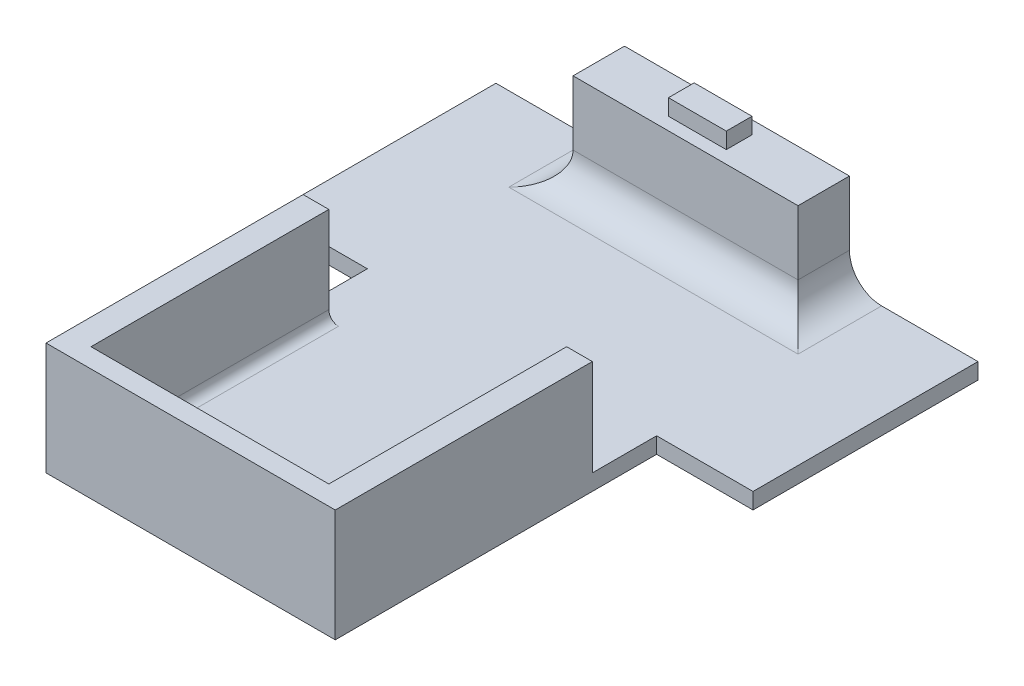
ISO-10303-21;
HEADER;
FILE_DESCRIPTION(('STEP AP214'),'2;1');
FILE_NAME('part.step','',(''),(''),'','','');
FILE_SCHEMA(('AUTOMOTIVE_DESIGN { 1 0 10303 214 1 1 1 1 }'));
ENDSEC;
DATA;
#1=APPLICATION_CONTEXT('core data for automotive mechanical design processes');
#2=APPLICATION_PROTOCOL_DEFINITION('international standard','automotive_design',2000,#1);
#3=PRODUCT_CONTEXT('',#1,'mechanical');
#4=PRODUCT('Part','Part','',(#3));
#5=PRODUCT_RELATED_PRODUCT_CATEGORY('part','',(#4));
#6=PRODUCT_DEFINITION_FORMATION('','',#4);
#7=PRODUCT_DEFINITION_CONTEXT('part definition',#1,'design');
#8=PRODUCT_DEFINITION('design','',#6,#7);
#9=PRODUCT_DEFINITION_SHAPE('','',#8);
#10=(LENGTH_UNIT() NAMED_UNIT(*) SI_UNIT(.MILLI.,.METRE.));
#11=(NAMED_UNIT(*) PLANE_ANGLE_UNIT() SI_UNIT($,.RADIAN.));
#12=(NAMED_UNIT(*) SI_UNIT($,.STERADIAN.) SOLID_ANGLE_UNIT());
#13=UNCERTAINTY_MEASURE_WITH_UNIT(LENGTH_MEASURE(1.E-05),#10,'distance_accuracy_value','');
#14=(GEOMETRIC_REPRESENTATION_CONTEXT(3) GLOBAL_UNCERTAINTY_ASSIGNED_CONTEXT((#13)) GLOBAL_UNIT_ASSIGNED_CONTEXT((#10,
#11,#12)) REPRESENTATION_CONTEXT('',''));
#15=CARTESIAN_POINT('',(0.,0.,0.));
#16=DIRECTION('',(0.,0.,1.));
#17=DIRECTION('',(1.,0.,0.));
#18=AXIS2_PLACEMENT_3D('',#15,#16,#17);
#19=CARTESIAN_POINT('',(0.,5.,0.));
#20=DIRECTION('',(0.,-1.,0.));
#21=DIRECTION('',(0.,0.,-1.));
#22=AXIS2_PLACEMENT_3D('',#19,#20,#21);
#23=PLANE('',#22);
#24=DIRECTION('',(-1.,0.,0.));
#25=VECTOR('',#24,1.);
#26=CARTESIAN_POINT('',(0.,5.,4.99999999999999));
#27=LINE('',#26,#25);
#28=CARTESIAN_POINT('',(-34.,5.,4.99999999999999));
#29=VERTEX_POINT('',#28);
#30=CARTESIAN_POINT('',(-45.,5.,4.99999999999999));
#31=VERTEX_POINT('',#30);
#32=EDGE_CURVE('E280',#29,#31,#27,.T.);
#33=ORIENTED_EDGE('',*,*,#32,.F.);
#34=DIRECTION('',(0.,0.,1.));
#35=VECTOR('',#34,1.);
#36=CARTESIAN_POINT('',(-34.,5.,0.));
#37=LINE('',#36,#35);
#38=CARTESIAN_POINT('',(-34.,5.,76.));
#39=VERTEX_POINT('',#38);
#40=EDGE_CURVE('E477',#29,#39,#37,.T.);
#41=ORIENTED_EDGE('',*,*,#40,.T.);
#42=DIRECTION('',(1.,0.,0.));
#43=VECTOR('',#42,1.);
#44=CARTESIAN_POINT('',(0.,5.,76.));
#45=LINE('',#44,#43);
#46=CARTESIAN_POINT('',(34.,5.,76.));
#47=VERTEX_POINT('',#46);
#48=EDGE_CURVE('E473',#39,#47,#45,.T.);
#49=ORIENTED_EDGE('',*,*,#48,.T.);
#50=DIRECTION('',(0.,0.,1.));
#51=VECTOR('',#50,1.);
#52=CARTESIAN_POINT('',(34.,5.,4.99999999999999));
#53=LINE('',#52,#51);
#54=CARTESIAN_POINT('',(34.,5.,4.99999999999999));
#55=VERTEX_POINT('',#54);
#56=EDGE_CURVE('E462',#47,#55,#53,.F.);
#57=ORIENTED_EDGE('',*,*,#56,.T.);
#58=DIRECTION('',(1.,0.,0.));
#59=VECTOR('',#58,1.);
#60=CARTESIAN_POINT('',(0.,5.,5.));
#61=LINE('',#60,#59);
#62=CARTESIAN_POINT('',(45.,5.,4.99999999999999));
#63=VERTEX_POINT('',#62);
#64=EDGE_CURVE('E286',#55,#63,#61,.T.);
#65=ORIENTED_EDGE('',*,*,#64,.T.);
#66=DIRECTION('',(0.,0.,-1.));
#67=VECTOR('',#66,1.);
#68=CARTESIAN_POINT('',(45.,5.,-15.));
#69=LINE('',#68,#67);
#70=CARTESIAN_POINT('',(45.,5.,-15.));
#71=VERTEX_POINT('',#70);
#72=EDGE_CURVE('E376',#63,#71,#69,.T.);
#73=ORIENTED_EDGE('',*,*,#72,.T.);
#74=DIRECTION('',(1.,0.,0.));
#75=VECTOR('',#74,1.);
#76=CARTESIAN_POINT('',(75.,5.,-15.));
#77=LINE('',#76,#75);
#78=CARTESIAN_POINT('',(75.,5.,-15.));
#79=VERTEX_POINT('',#78);
#80=EDGE_CURVE('E379',#71,#79,#77,.T.);
#81=ORIENTED_EDGE('',*,*,#80,.T.);
#82=DIRECTION('',(0.,0.,-1.));
#83=VECTOR('',#82,1.);
#84=CARTESIAN_POINT('',(75.,5.,-15.));
#85=LINE('',#84,#83);
#86=CARTESIAN_POINT('',(75.,5.,-85.));
#87=VERTEX_POINT('',#86);
#88=EDGE_CURVE('E356',#79,#87,#85,.T.);
#89=ORIENTED_EDGE('',*,*,#88,.T.);
#90=DIRECTION('',(-1.,0.,0.));
#91=VECTOR('',#90,1.);
#92=CARTESIAN_POINT('',(-75.,5.,-85.));
#93=LINE('',#92,#91);
#94=CARTESIAN_POINT('',(45.,5.,-85.));
#95=VERTEX_POINT('',#94);
#96=EDGE_CURVE('E362',#87,#95,#93,.T.);
#97=ORIENTED_EDGE('',*,*,#96,.T.);
#98=DIRECTION('',(0.,0.,-1.));
#99=VECTOR('',#98,1.);
#100=CARTESIAN_POINT('',(45.,5.,-69.));
#101=LINE('',#100,#99);
#102=CARTESIAN_POINT('',(45.,5.,-59.));
#103=VERTEX_POINT('',#102);
#104=EDGE_CURVE('E447',#95,#103,#101,.F.);
#105=ORIENTED_EDGE('',*,*,#104,.T.);
#106=DIRECTION('',(1.,0.,0.));
#107=VECTOR('',#106,1.);
#108=CARTESIAN_POINT('',(-35.,5.,-59.));
#109=LINE('',#108,#107);
#110=CARTESIAN_POINT('',(-45.,5.,-59.));
#111=VERTEX_POINT('',#110);
#112=EDGE_CURVE('E441',#103,#111,#109,.F.);
#113=ORIENTED_EDGE('',*,*,#112,.T.);
#114=DIRECTION('',(0.,0.,-1.));
#115=VECTOR('',#114,1.);
#116=CARTESIAN_POINT('',(-45.,5.,0.));
#117=LINE('',#116,#115);
#118=CARTESIAN_POINT('',(-45.,5.,-85.));
#119=VERTEX_POINT('',#118);
#120=EDGE_CURVE('E444',#111,#119,#117,.T.);
#121=ORIENTED_EDGE('',*,*,#120,.T.);
#122=CARTESIAN_POINT('',(-75.,5.,-85.));
#123=VERTEX_POINT('',#122);
#124=EDGE_CURVE('E360',#119,#123,#93,.T.);
#125=ORIENTED_EDGE('',*,*,#124,.T.);
#126=DIRECTION('',(0.,0.,1.));
#127=VECTOR('',#126,1.);
#128=CARTESIAN_POINT('',(-75.,5.,-15.));
#129=LINE('',#128,#127);
#130=CARTESIAN_POINT('',(-75.,5.,-15.));
#131=VERTEX_POINT('',#130);
#132=EDGE_CURVE('E366',#123,#131,#129,.T.);
#133=ORIENTED_EDGE('',*,*,#132,.T.);
#134=DIRECTION('',(1.,0.,0.));
#135=VECTOR('',#134,1.);
#136=CARTESIAN_POINT('',(-75.,5.,-15.));
#137=LINE('',#136,#135);
#138=CARTESIAN_POINT('',(-45.,5.,-15.));
#139=VERTEX_POINT('',#138);
#140=EDGE_CURVE('E369',#131,#139,#137,.T.);
#141=ORIENTED_EDGE('',*,*,#140,.T.);
#142=DIRECTION('',(0.,0.,1.));
#143=VECTOR('',#142,1.);
#144=CARTESIAN_POINT('',(-45.,5.,-15.));
#145=LINE('',#144,#143);
#146=EDGE_CURVE('E372',#139,#31,#145,.T.);
#147=ORIENTED_EDGE('',*,*,#146,.T.);
#148=EDGE_LOOP('',(#33,#41,#49,#57,#65,#73,#81,#89,#97,#105,#113,#121,#125,#133,#141,#147));
#149=FACE_BOUND('',#148,.T.);
#150=CARTESIAN_POINT('',(8.5,5.,60.4507901298103));
#151=DIRECTION('',(0.,1.,0.));
#152=DIRECTION('',(0.,0.,1.));
#153=AXIS2_PLACEMENT_3D('',#150,#151,#152);
#154=CIRCLE('',#153,2.5);
#155=CARTESIAN_POINT('',(8.5,5.,62.9507901298103));
#156=VERTEX_POINT('',#155);
#157=EDGE_CURVE('E340',#156,#156,#154,.T.);
#158=ORIENTED_EDGE('',*,*,#157,.F.);
#159=EDGE_LOOP('',(#158));
#160=FACE_BOUND('',#159,.T.);
#161=CARTESIAN_POINT('',(-8.5,5.,60.4507901298103));
#162=DIRECTION('',(0.,1.,0.));
#163=DIRECTION('',(0.,0.,1.));
#164=AXIS2_PLACEMENT_3D('',#161,#162,#163);
#165=CIRCLE('',#164,2.5);
#166=CARTESIAN_POINT('',(-8.5,5.,62.9507901298103));
#167=VERTEX_POINT('',#166);
#168=EDGE_CURVE('E348',#167,#167,#165,.T.);
#169=ORIENTED_EDGE('',*,*,#168,.F.);
#170=EDGE_LOOP('',(#169));
#171=FACE_BOUND('',#170,.T.);
#172=ADVANCED_FACE('F43',(#149,#160,#171),#23,.F.);
#173=CARTESIAN_POINT('',(0.,0.,0.));
#174=DIRECTION('',(0.,-1.,0.));
#175=DIRECTION('',(0.,0.,-1.));
#176=AXIS2_PLACEMENT_3D('',#173,#174,#175);
#177=PLANE('',#176);
#178=CARTESIAN_POINT('',(-8.5,0.,60.4507901298103));
#179=DIRECTION('',(0.,1.,0.));
#180=DIRECTION('',(0.,0.,1.));
#181=AXIS2_PLACEMENT_3D('',#178,#179,#180);
#182=CIRCLE('',#181,2.5);
#183=CARTESIAN_POINT('',(-8.5,0.,62.9507901298103));
#184=VERTEX_POINT('',#183);
#185=EDGE_CURVE('E344',#184,#184,#182,.T.);
#186=ORIENTED_EDGE('',*,*,#185,.T.);
#187=EDGE_LOOP('',(#186));
#188=FACE_BOUND('',#187,.T.);
#189=DIRECTION('',(0.,0.,-1.));
#190=VECTOR('',#189,1.);
#191=CARTESIAN_POINT('',(75.,0.,-15.));
#192=LINE('',#191,#190);
#193=CARTESIAN_POINT('',(75.,0.,-15.));
#194=VERTEX_POINT('',#193);
#195=CARTESIAN_POINT('',(75.,0.,-85.));
#196=VERTEX_POINT('',#195);
#197=EDGE_CURVE('E352',#194,#196,#192,.T.);
#198=ORIENTED_EDGE('',*,*,#197,.F.);
#199=DIRECTION('',(1.,0.,0.));
#200=VECTOR('',#199,1.);
#201=CARTESIAN_POINT('',(75.,0.,-15.));
#202=LINE('',#201,#200);
#203=CARTESIAN_POINT('',(45.,0.,-15.));
#204=VERTEX_POINT('',#203);
#205=EDGE_CURVE('E361',#204,#194,#202,.T.);
#206=ORIENTED_EDGE('',*,*,#205,.F.);
#207=DIRECTION('',(0.,0.,-1.));
#208=VECTOR('',#207,1.);
#209=CARTESIAN_POINT('',(45.,0.,-15.));
#210=LINE('',#209,#208);
#211=CARTESIAN_POINT('',(45.,0.,85.));
#212=VERTEX_POINT('',#211);
#213=EDGE_CURVE('E401',#212,#204,#210,.T.);
#214=ORIENTED_EDGE('',*,*,#213,.F.);
#215=DIRECTION('',(1.,0.,0.));
#216=VECTOR('',#215,1.);
#217=CARTESIAN_POINT('',(-45.,0.,85.));
#218=LINE('',#217,#216);
#219=CARTESIAN_POINT('',(-45.,0.,85.));
#220=VERTEX_POINT('',#219);
#221=EDGE_CURVE('E398',#220,#212,#218,.T.);
#222=ORIENTED_EDGE('',*,*,#221,.F.);
#223=DIRECTION('',(0.,0.,1.));
#224=VECTOR('',#223,1.);
#225=CARTESIAN_POINT('',(-45.,0.,-15.));
#226=LINE('',#225,#224);
#227=CARTESIAN_POINT('',(-45.,0.,-15.));
#228=VERTEX_POINT('',#227);
#229=EDGE_CURVE('E395',#228,#220,#226,.T.);
#230=ORIENTED_EDGE('',*,*,#229,.F.);
#231=DIRECTION('',(1.,0.,0.));
#232=VECTOR('',#231,1.);
#233=CARTESIAN_POINT('',(-75.,0.,-15.));
#234=LINE('',#233,#232);
#235=CARTESIAN_POINT('',(-75.,0.,-15.));
#236=VERTEX_POINT('',#235);
#237=EDGE_CURVE('E392',#236,#228,#234,.T.);
#238=ORIENTED_EDGE('',*,*,#237,.F.);
#239=DIRECTION('',(0.,0.,1.));
#240=VECTOR('',#239,1.);
#241=CARTESIAN_POINT('',(-75.,0.,-15.));
#242=LINE('',#241,#240);
#243=CARTESIAN_POINT('',(-75.,0.,-85.));
#244=VERTEX_POINT('',#243);
#245=EDGE_CURVE('E389',#244,#236,#242,.T.);
#246=ORIENTED_EDGE('',*,*,#245,.F.);
#247=DIRECTION('',(-1.,0.,0.));
#248=VECTOR('',#247,1.);
#249=CARTESIAN_POINT('',(-75.,0.,-85.));
#250=LINE('',#249,#248);
#251=EDGE_CURVE('E386',#196,#244,#250,.T.);
#252=ORIENTED_EDGE('',*,*,#251,.F.);
#253=EDGE_LOOP('',(#198,#206,#214,#222,#230,#238,#246,#252));
#254=FACE_BOUND('',#253,.T.);
#255=CARTESIAN_POINT('',(8.5,0.,60.4507901298103));
#256=DIRECTION('',(0.,1.,0.));
#257=DIRECTION('',(0.,0.,1.));
#258=AXIS2_PLACEMENT_3D('',#255,#256,#257);
#259=CIRCLE('',#258,2.5);
#260=CARTESIAN_POINT('',(8.5,0.,62.9507901298103));
#261=VERTEX_POINT('',#260);
#262=EDGE_CURVE('E339',#261,#261,#259,.T.);
#263=ORIENTED_EDGE('',*,*,#262,.T.);
#264=EDGE_LOOP('',(#263));
#265=FACE_BOUND('',#264,.T.);
#266=ADVANCED_FACE('F539',(#188,#254,#265),#177,.T.);
#267=CARTESIAN_POINT('',(75.,5.,-15.));
#268=DIRECTION('',(-1.,0.,0.));
#269=DIRECTION('',(0.,0.,1.));
#270=AXIS2_PLACEMENT_3D('',#267,#268,#269);
#271=PLANE('',#270);
#272=ORIENTED_EDGE('',*,*,#197,.T.);
#273=DIRECTION('',(0.,-1.,0.));
#274=VECTOR('',#273,1.);
#275=CARTESIAN_POINT('',(75.,5.,-85.));
#276=LINE('',#275,#274);
#277=EDGE_CURVE('E433',#87,#196,#276,.T.);
#278=ORIENTED_EDGE('',*,*,#277,.F.);
#279=ORIENTED_EDGE('',*,*,#88,.F.);
#280=DIRECTION('',(0.,-1.,0.));
#281=VECTOR('',#280,1.);
#282=CARTESIAN_POINT('',(75.,5.,-15.));
#283=LINE('',#282,#281);
#284=EDGE_CURVE('E382',#79,#194,#283,.T.);
#285=ORIENTED_EDGE('',*,*,#284,.T.);
#286=EDGE_LOOP('',(#272,#278,#279,#285));
#287=FACE_BOUND('',#286,.T.);
#288=ADVANCED_FACE('F578',(#287),#271,.F.);
#289=CARTESIAN_POINT('',(-75.,5.,-85.));
#290=DIRECTION('',(0.,0.,1.));
#291=DIRECTION('',(1.,0.,0.));
#292=AXIS2_PLACEMENT_3D('',#289,#290,#291);
#293=PLANE('',#292);
#294=ORIENTED_EDGE('',*,*,#251,.T.);
#295=DIRECTION('',(0.,-1.,0.));
#296=VECTOR('',#295,1.);
#297=CARTESIAN_POINT('',(-75.,5.,-85.));
#298=LINE('',#297,#296);
#299=EDGE_CURVE('E429',#123,#244,#298,.T.);
#300=ORIENTED_EDGE('',*,*,#299,.F.);
#301=ORIENTED_EDGE('',*,*,#124,.F.);
#302=CARTESIAN_POINT('',(-45.,15.,-85.));
#303=DIRECTION('',(0.,0.,1.));
#304=DIRECTION('',(1.,0.,0.));
#305=AXIS2_PLACEMENT_3D('',#302,#303,#304);
#306=CIRCLE('',#305,10.);
#307=CARTESIAN_POINT('',(-35.,15.,-85.));
#308=VERTEX_POINT('',#307);
#309=EDGE_CURVE('E459',#119,#308,#306,.T.);
#310=ORIENTED_EDGE('',*,*,#309,.T.);
#311=DIRECTION('',(0.,-1.,0.));
#312=VECTOR('',#311,1.);
#313=CARTESIAN_POINT('',(-35.,35.,-85.));
#314=LINE('',#313,#312);
#315=CARTESIAN_POINT('',(-35.,35.,-85.));
#316=VERTEX_POINT('',#315);
#317=EDGE_CURVE('E268',#316,#308,#314,.T.);
#318=ORIENTED_EDGE('',*,*,#317,.F.);
#319=DIRECTION('',(-1.,0.,0.));
#320=VECTOR('',#319,1.);
#321=CARTESIAN_POINT('',(0.,35.,-85.));
#322=LINE('',#321,#320);
#323=CARTESIAN_POINT('',(35.,35.,-85.));
#324=VERTEX_POINT('',#323);
#325=EDGE_CURVE('E257',#324,#316,#322,.T.);
#326=ORIENTED_EDGE('',*,*,#325,.F.);
#327=DIRECTION('',(0.,-1.,0.));
#328=VECTOR('',#327,1.);
#329=CARTESIAN_POINT('',(35.,35.,-85.));
#330=LINE('',#329,#328);
#331=CARTESIAN_POINT('',(35.,15.,-85.));
#332=VERTEX_POINT('',#331);
#333=EDGE_CURVE('E272',#324,#332,#330,.T.);
#334=ORIENTED_EDGE('',*,*,#333,.T.);
#335=CARTESIAN_POINT('',(45.,15.,-85.));
#336=DIRECTION('',(0.,0.,1.));
#337=DIRECTION('',(1.,0.,0.));
#338=AXIS2_PLACEMENT_3D('',#335,#336,#337);
#339=CIRCLE('',#338,10.);
#340=EDGE_CURVE('E456',#332,#95,#339,.T.);
#341=ORIENTED_EDGE('',*,*,#340,.T.);
#342=ORIENTED_EDGE('',*,*,#96,.F.);
#343=ORIENTED_EDGE('',*,*,#277,.T.);
#344=EDGE_LOOP('',(#294,#300,#301,#310,#318,#326,#334,#341,#342,#343));
#345=FACE_BOUND('',#344,.T.);
#346=ADVANCED_FACE('F530',(#345),#293,.F.);
#347=CARTESIAN_POINT('',(-75.,5.,-15.));
#348=DIRECTION('',(1.,0.,0.));
#349=DIRECTION('',(0.,0.,-1.));
#350=AXIS2_PLACEMENT_3D('',#347,#348,#349);
#351=PLANE('',#350);
#352=ORIENTED_EDGE('',*,*,#245,.T.);
#353=DIRECTION('',(0.,-1.,0.));
#354=VECTOR('',#353,1.);
#355=CARTESIAN_POINT('',(-75.,5.,-15.));
#356=LINE('',#355,#354);
#357=EDGE_CURVE('E425',#131,#236,#356,.T.);
#358=ORIENTED_EDGE('',*,*,#357,.F.);
#359=ORIENTED_EDGE('',*,*,#132,.F.);
#360=ORIENTED_EDGE('',*,*,#299,.T.);
#361=EDGE_LOOP('',(#352,#358,#359,#360));
#362=FACE_BOUND('',#361,.T.);
#363=ADVANCED_FACE('F533',(#362),#351,.F.);
#364=CARTESIAN_POINT('',(-75.,5.,-15.));
#365=DIRECTION('',(0.,0.,-1.));
#366=DIRECTION('',(-1.,0.,0.));
#367=AXIS2_PLACEMENT_3D('',#364,#365,#366);
#368=PLANE('',#367);
#369=ORIENTED_EDGE('',*,*,#237,.T.);
#370=DIRECTION('',(0.,-1.,0.));
#371=VECTOR('',#370,1.);
#372=CARTESIAN_POINT('',(-45.,5.,-15.));
#373=LINE('',#372,#371);
#374=EDGE_CURVE('E421',#139,#228,#373,.T.);
#375=ORIENTED_EDGE('',*,*,#374,.F.);
#376=ORIENTED_EDGE('',*,*,#140,.F.);
#377=ORIENTED_EDGE('',*,*,#357,.T.);
#378=EDGE_LOOP('',(#369,#375,#376,#377));
#379=FACE_BOUND('',#378,.T.);
#380=ADVANCED_FACE('F536',(#379),#368,.F.);
#381=CARTESIAN_POINT('',(-45.,5.,-15.));
#382=DIRECTION('',(1.,0.,0.));
#383=DIRECTION('',(0.,0.,-1.));
#384=AXIS2_PLACEMENT_3D('',#381,#382,#383);
#385=PLANE('',#384);
#386=ORIENTED_EDGE('',*,*,#229,.T.);
#387=DIRECTION('',(0.,-1.,0.));
#388=VECTOR('',#387,1.);
#389=CARTESIAN_POINT('',(-45.,5.,85.));
#390=LINE('',#389,#388);
#391=CARTESIAN_POINT('',(-45.,35.,85.));
#392=VERTEX_POINT('',#391);
#393=EDGE_CURVE('E417',#392,#220,#390,.T.);
#394=ORIENTED_EDGE('',*,*,#393,.F.);
#395=DIRECTION('',(0.,0.,1.));
#396=VECTOR('',#395,1.);
#397=CARTESIAN_POINT('',(-45.,35.,0.));
#398=LINE('',#397,#396);
#399=CARTESIAN_POINT('',(-45.,35.,4.99999999999999));
#400=VERTEX_POINT('',#399);
#401=EDGE_CURVE('E293',#400,#392,#398,.T.);
#402=ORIENTED_EDGE('',*,*,#401,.F.);
#403=DIRECTION('',(0.,-1.,0.));
#404=VECTOR('',#403,1.);
#405=CARTESIAN_POINT('',(-45.,35.,4.99999999999999));
#406=LINE('',#405,#404);
#407=EDGE_CURVE('E327',#400,#31,#406,.T.);
#408=ORIENTED_EDGE('',*,*,#407,.T.);
#409=ORIENTED_EDGE('',*,*,#146,.F.);
#410=ORIENTED_EDGE('',*,*,#374,.T.);
#411=EDGE_LOOP('',(#386,#394,#402,#408,#409,#410));
#412=FACE_BOUND('',#411,.T.);
#413=ADVANCED_FACE('F508',(#412),#385,.F.);
#414=CARTESIAN_POINT('',(-45.,5.,85.));
#415=DIRECTION('',(0.,0.,-1.));
#416=DIRECTION('',(-1.,0.,0.));
#417=AXIS2_PLACEMENT_3D('',#414,#415,#416);
#418=PLANE('',#417);
#419=ORIENTED_EDGE('',*,*,#221,.T.);
#420=DIRECTION('',(0.,-1.,0.));
#421=VECTOR('',#420,1.);
#422=CARTESIAN_POINT('',(45.,5.,85.));
#423=LINE('',#422,#421);
#424=CARTESIAN_POINT('',(45.,35.,85.));
#425=VERTEX_POINT('',#424);
#426=EDGE_CURVE('E413',#425,#212,#423,.T.);
#427=ORIENTED_EDGE('',*,*,#426,.F.);
#428=DIRECTION('',(1.,0.,0.));
#429=VECTOR('',#428,1.);
#430=CARTESIAN_POINT('',(0.,35.,85.));
#431=LINE('',#430,#429);
#432=EDGE_CURVE('E297',#392,#425,#431,.T.);
#433=ORIENTED_EDGE('',*,*,#432,.F.);
#434=ORIENTED_EDGE('',*,*,#393,.T.);
#435=EDGE_LOOP('',(#419,#427,#433,#434));
#436=FACE_BOUND('',#435,.T.);
#437=ADVANCED_FACE('F545',(#436),#418,.F.);
#438=CARTESIAN_POINT('',(45.,5.,-15.));
#439=DIRECTION('',(-1.,0.,0.));
#440=DIRECTION('',(0.,0.,1.));
#441=AXIS2_PLACEMENT_3D('',#438,#439,#440);
#442=PLANE('',#441);
#443=ORIENTED_EDGE('',*,*,#213,.T.);
#444=DIRECTION('',(0.,-1.,0.));
#445=VECTOR('',#444,1.);
#446=CARTESIAN_POINT('',(45.,5.,-15.));
#447=LINE('',#446,#445);
#448=EDGE_CURVE('E409',#71,#204,#447,.T.);
#449=ORIENTED_EDGE('',*,*,#448,.F.);
#450=ORIENTED_EDGE('',*,*,#72,.F.);
#451=DIRECTION('',(0.,-1.,0.));
#452=VECTOR('',#451,1.);
#453=CARTESIAN_POINT('',(45.,35.,4.99999999999999));
#454=LINE('',#453,#452);
#455=CARTESIAN_POINT('',(45.,35.,4.99999999999999));
#456=VERTEX_POINT('',#455);
#457=EDGE_CURVE('E324',#456,#63,#454,.T.);
#458=ORIENTED_EDGE('',*,*,#457,.F.);
#459=DIRECTION('',(0.,0.,-1.));
#460=VECTOR('',#459,1.);
#461=CARTESIAN_POINT('',(45.,35.,0.));
#462=LINE('',#461,#460);
#463=EDGE_CURVE('E301',#425,#456,#462,.T.);
#464=ORIENTED_EDGE('',*,*,#463,.F.);
#465=ORIENTED_EDGE('',*,*,#426,.T.);
#466=EDGE_LOOP('',(#443,#449,#450,#458,#464,#465));
#467=FACE_BOUND('',#466,.T.);
#468=ADVANCED_FACE('F550',(#467),#442,.F.);
#469=CARTESIAN_POINT('',(75.,5.,-15.));
#470=DIRECTION('',(0.,0.,-1.));
#471=DIRECTION('',(-1.,0.,0.));
#472=AXIS2_PLACEMENT_3D('',#469,#470,#471);
#473=PLANE('',#472);
#474=ORIENTED_EDGE('',*,*,#205,.T.);
#475=ORIENTED_EDGE('',*,*,#284,.F.);
#476=ORIENTED_EDGE('',*,*,#80,.F.);
#477=ORIENTED_EDGE('',*,*,#448,.T.);
#478=EDGE_LOOP('',(#474,#475,#476,#477));
#479=FACE_BOUND('',#478,.T.);
#480=ADVANCED_FACE('F583',(#479),#473,.F.);
#481=CARTESIAN_POINT('',(-8.5,5.,60.4507901298103));
#482=DIRECTION('',(0.,-1.,0.));
#483=DIRECTION('',(0.,0.,-1.));
#484=AXIS2_PLACEMENT_3D('',#481,#482,#483);
#485=CYLINDRICAL_SURFACE('',#484,2.5);
#486=ORIENTED_EDGE('',*,*,#168,.T.);
#487=EDGE_LOOP('',(#486));
#488=FACE_BOUND('',#487,.T.);
#489=ORIENTED_EDGE('',*,*,#185,.F.);
#490=EDGE_LOOP('',(#489));
#491=FACE_BOUND('',#490,.T.);
#492=ADVANCED_FACE('F570',(#488,#491),#485,.F.);
#493=CARTESIAN_POINT('',(8.5,5.,60.4507901298103));
#494=DIRECTION('',(0.,-1.,0.));
#495=DIRECTION('',(0.,0.,-1.));
#496=AXIS2_PLACEMENT_3D('',#493,#494,#495);
#497=CYLINDRICAL_SURFACE('',#496,2.5);
#498=ORIENTED_EDGE('',*,*,#157,.T.);
#499=EDGE_LOOP('',(#498));
#500=FACE_BOUND('',#499,.T.);
#501=ORIENTED_EDGE('',*,*,#262,.F.);
#502=EDGE_LOOP('',(#501));
#503=FACE_BOUND('',#502,.T.);
#504=ADVANCED_FACE('F563',(#500,#503),#497,.F.);
#505=CARTESIAN_POINT('',(0.,35.,79.));
#506=DIRECTION('',(0.,0.,-1.));
#507=DIRECTION('',(-1.,0.,0.));
#508=AXIS2_PLACEMENT_3D('',#505,#506,#507);
#509=PLANE('',#508);
#510=DIRECTION('',(0.,-1.,0.));
#511=VECTOR('',#510,1.);
#512=CARTESIAN_POINT('',(37.,35.,79.));
#513=LINE('',#512,#511);
#514=CARTESIAN_POINT('',(37.,35.,79.));
#515=VERTEX_POINT('',#514);
#516=CARTESIAN_POINT('',(37.,8.,79.));
#517=VERTEX_POINT('',#516);
#518=EDGE_CURVE('E311',#515,#517,#513,.T.);
#519=ORIENTED_EDGE('',*,*,#518,.T.);
#520=DIRECTION('',(1.,0.,0.));
#521=VECTOR('',#520,1.);
#522=CARTESIAN_POINT('',(0.,8.,79.));
#523=LINE('',#522,#521);
#524=CARTESIAN_POINT('',(-37.,8.,79.));
#525=VERTEX_POINT('',#524);
#526=EDGE_CURVE('E480',#517,#525,#523,.F.);
#527=ORIENTED_EDGE('',*,*,#526,.T.);
#528=DIRECTION('',(0.,-1.,0.));
#529=VECTOR('',#528,1.);
#530=CARTESIAN_POINT('',(-37.,35.,79.));
#531=LINE('',#530,#529);
#532=CARTESIAN_POINT('',(-37.,35.,79.));
#533=VERTEX_POINT('',#532);
#534=EDGE_CURVE('E335',#533,#525,#531,.T.);
#535=ORIENTED_EDGE('',*,*,#534,.F.);
#536=DIRECTION('',(1.,0.,0.));
#537=VECTOR('',#536,1.);
#538=CARTESIAN_POINT('',(0.,35.,79.));
#539=LINE('',#538,#537);
#540=EDGE_CURVE('E281',#533,#515,#539,.T.);
#541=ORIENTED_EDGE('',*,*,#540,.T.);
#542=EDGE_LOOP('',(#519,#527,#535,#541));
#543=FACE_BOUND('',#542,.T.);
#544=ADVANCED_FACE('F561',(#543),#509,.T.);
#545=CARTESIAN_POINT('',(-37.,35.,0.));
#546=DIRECTION('',(1.,0.,0.));
#547=DIRECTION('',(0.,0.,-1.));
#548=AXIS2_PLACEMENT_3D('',#545,#546,#547);
#549=PLANE('',#548);
#550=ORIENTED_EDGE('',*,*,#534,.T.);
#551=DIRECTION('',(0.,0.,1.));
#552=VECTOR('',#551,1.);
#553=CARTESIAN_POINT('',(-37.,8.,0.));
#554=LINE('',#553,#552);
#555=CARTESIAN_POINT('',(-37.,8.,4.99999999999999));
#556=VERTEX_POINT('',#555);
#557=EDGE_CURVE('E483',#525,#556,#554,.F.);
#558=ORIENTED_EDGE('',*,*,#557,.T.);
#559=DIRECTION('',(0.,-1.,0.));
#560=VECTOR('',#559,1.);
#561=CARTESIAN_POINT('',(-37.,35.,4.99999999999999));
#562=LINE('',#561,#560);
#563=CARTESIAN_POINT('',(-37.,35.,4.99999999999999));
#564=VERTEX_POINT('',#563);
#565=EDGE_CURVE('E331',#564,#556,#562,.T.);
#566=ORIENTED_EDGE('',*,*,#565,.F.);
#567=DIRECTION('',(0.,0.,1.));
#568=VECTOR('',#567,1.);
#569=CARTESIAN_POINT('',(-37.,35.,0.));
#570=LINE('',#569,#568);
#571=EDGE_CURVE('E285',#564,#533,#570,.T.);
#572=ORIENTED_EDGE('',*,*,#571,.T.);
#573=EDGE_LOOP('',(#550,#558,#566,#572));
#574=FACE_BOUND('',#573,.T.);
#575=ADVANCED_FACE('F516',(#574),#549,.T.);
#576=CARTESIAN_POINT('',(0.,35.,4.99999999999999));
#577=DIRECTION('',(0.,0.,1.));
#578=DIRECTION('',(1.,0.,0.));
#579=AXIS2_PLACEMENT_3D('',#576,#577,#578);
#580=PLANE('',#579);
#581=ORIENTED_EDGE('',*,*,#32,.T.);
#582=ORIENTED_EDGE('',*,*,#407,.F.);
#583=DIRECTION('',(-1.,0.,0.));
#584=VECTOR('',#583,1.);
#585=CARTESIAN_POINT('',(0.,35.,4.99999999999999));
#586=LINE('',#585,#584);
#587=EDGE_CURVE('E290',#564,#400,#586,.T.);
#588=ORIENTED_EDGE('',*,*,#587,.F.);
#589=ORIENTED_EDGE('',*,*,#565,.T.);
#590=CARTESIAN_POINT('',(-34.,8.,4.99999999999999));
#591=DIRECTION('',(0.,0.,1.));
#592=DIRECTION('',(1.,0.,0.));
#593=AXIS2_PLACEMENT_3D('',#590,#591,#592);
#594=CIRCLE('',#593,3.);
#595=EDGE_CURVE('E53',#556,#29,#594,.T.);
#596=ORIENTED_EDGE('',*,*,#595,.T.);
#597=EDGE_LOOP('',(#581,#582,#588,#589,#596));
#598=FACE_BOUND('',#597,.T.);
#599=ADVANCED_FACE('F494',(#598),#580,.F.);
#600=CARTESIAN_POINT('',(0.,35.,5.));
#601=DIRECTION('',(0.,0.,-1.));
#602=DIRECTION('',(-1.,0.,0.));
#603=AXIS2_PLACEMENT_3D('',#600,#601,#602);
#604=PLANE('',#603);
#605=ORIENTED_EDGE('',*,*,#64,.F.);
#606=CARTESIAN_POINT('',(34.,8.,4.99999999999999));
#607=DIRECTION('',(0.,0.,-1.));
#608=DIRECTION('',(-1.,0.,0.));
#609=AXIS2_PLACEMENT_3D('',#606,#607,#608);
#610=CIRCLE('',#609,3.);
#611=CARTESIAN_POINT('',(37.,8.,4.99999999999999));
#612=VERTEX_POINT('',#611);
#613=EDGE_CURVE('E11',#55,#612,#610,.F.);
#614=ORIENTED_EDGE('',*,*,#613,.T.);
#615=DIRECTION('',(0.,-1.,0.));
#616=VECTOR('',#615,1.);
#617=CARTESIAN_POINT('',(37.,35.,4.99999999999999));
#618=LINE('',#617,#616);
#619=CARTESIAN_POINT('',(37.,35.,4.99999999999999));
#620=VERTEX_POINT('',#619);
#621=EDGE_CURVE('E320',#620,#612,#618,.T.);
#622=ORIENTED_EDGE('',*,*,#621,.F.);
#623=DIRECTION('',(1.,0.,0.));
#624=VECTOR('',#623,1.);
#625=CARTESIAN_POINT('',(0.,35.,5.));
#626=LINE('',#625,#624);
#627=EDGE_CURVE('E304',#620,#456,#626,.T.);
#628=ORIENTED_EDGE('',*,*,#627,.T.);
#629=ORIENTED_EDGE('',*,*,#457,.T.);
#630=EDGE_LOOP('',(#605,#614,#622,#628,#629));
#631=FACE_BOUND('',#630,.T.);
#632=ADVANCED_FACE('F554',(#631),#604,.T.);
#633=CARTESIAN_POINT('',(37.,35.,0.));
#634=DIRECTION('',(1.,0.,0.));
#635=DIRECTION('',(0.,0.,-1.));
#636=AXIS2_PLACEMENT_3D('',#633,#634,#635);
#637=PLANE('',#636);
#638=ORIENTED_EDGE('',*,*,#621,.T.);
#639=DIRECTION('',(0.,0.,1.));
#640=VECTOR('',#639,1.);
#641=CARTESIAN_POINT('',(37.,8.,79.));
#642=LINE('',#641,#640);
#643=EDGE_CURVE('E486',#612,#517,#642,.T.);
#644=ORIENTED_EDGE('',*,*,#643,.T.);
#645=ORIENTED_EDGE('',*,*,#518,.F.);
#646=DIRECTION('',(0.,0.,1.));
#647=VECTOR('',#646,1.);
#648=CARTESIAN_POINT('',(37.,35.,0.));
#649=LINE('',#648,#647);
#650=EDGE_CURVE('E308',#620,#515,#649,.T.);
#651=ORIENTED_EDGE('',*,*,#650,.F.);
#652=EDGE_LOOP('',(#638,#644,#645,#651));
#653=FACE_BOUND('',#652,.T.);
#654=ADVANCED_FACE('F558',(#653),#637,.F.);
#655=CARTESIAN_POINT('',(0.,35.,0.));
#656=DIRECTION('',(0.,1.,0.));
#657=DIRECTION('',(0.,0.,1.));
#658=AXIS2_PLACEMENT_3D('',#655,#656,#657);
#659=PLANE('',#658);
#660=ORIENTED_EDGE('',*,*,#540,.F.);
#661=ORIENTED_EDGE('',*,*,#571,.F.);
#662=ORIENTED_EDGE('',*,*,#587,.T.);
#663=ORIENTED_EDGE('',*,*,#401,.T.);
#664=ORIENTED_EDGE('',*,*,#432,.T.);
#665=ORIENTED_EDGE('',*,*,#463,.T.);
#666=ORIENTED_EDGE('',*,*,#627,.F.);
#667=ORIENTED_EDGE('',*,*,#650,.T.);
#668=EDGE_LOOP('',(#660,#661,#662,#663,#664,#665,#666,#667));
#669=FACE_BOUND('',#668,.T.);
#670=ADVANCED_FACE('F514',(#669),#659,.T.);
#671=CARTESIAN_POINT('',(0.,35.,-69.));
#672=DIRECTION('',(0.,0.,-1.));
#673=DIRECTION('',(-1.,0.,0.));
#674=AXIS2_PLACEMENT_3D('',#671,#672,#673);
#675=PLANE('',#674);
#676=DIRECTION('',(0.,-1.,0.));
#677=VECTOR('',#676,1.);
#678=CARTESIAN_POINT('',(-35.,35.,-69.));
#679=LINE('',#678,#677);
#680=CARTESIAN_POINT('',(-35.,35.,-69.));
#681=VERTEX_POINT('',#680);
#682=CARTESIAN_POINT('',(-35.,15.,-69.));
#683=VERTEX_POINT('',#682);
#684=EDGE_CURVE('E264',#681,#683,#679,.T.);
#685=ORIENTED_EDGE('',*,*,#684,.T.);
#686=DIRECTION('',(1.,0.,0.));
#687=VECTOR('',#686,1.);
#688=CARTESIAN_POINT('',(35.,15.,-69.));
#689=LINE('',#688,#687);
#690=CARTESIAN_POINT('',(35.,15.,-69.));
#691=VERTEX_POINT('',#690);
#692=EDGE_CURVE('E453',#683,#691,#689,.T.);
#693=ORIENTED_EDGE('',*,*,#692,.T.);
#694=DIRECTION('',(0.,-1.,0.));
#695=VECTOR('',#694,1.);
#696=CARTESIAN_POINT('',(35.,35.,-69.));
#697=LINE('',#696,#695);
#698=CARTESIAN_POINT('',(35.,35.,-69.));
#699=VERTEX_POINT('',#698);
#700=EDGE_CURVE('E276',#699,#691,#697,.T.);
#701=ORIENTED_EDGE('',*,*,#700,.F.);
#702=DIRECTION('',(1.,0.,0.));
#703=VECTOR('',#702,1.);
#704=CARTESIAN_POINT('',(0.,35.,-69.));
#705=LINE('',#704,#703);
#706=EDGE_CURVE('E249',#681,#699,#705,.T.);
#707=ORIENTED_EDGE('',*,*,#706,.F.);
#708=EDGE_LOOP('',(#685,#693,#701,#707));
#709=FACE_BOUND('',#708,.T.);
#710=ADVANCED_FACE('F648',(#709),#675,.F.);
#711=CARTESIAN_POINT('',(35.,35.,0.));
#712=DIRECTION('',(-1.,0.,0.));
#713=DIRECTION('',(0.,0.,1.));
#714=AXIS2_PLACEMENT_3D('',#711,#712,#713);
#715=PLANE('',#714);
#716=ORIENTED_EDGE('',*,*,#700,.T.);
#717=DIRECTION('',(0.,0.,-1.));
#718=VECTOR('',#717,1.);
#719=CARTESIAN_POINT('',(35.,15.,-85.));
#720=LINE('',#719,#718);
#721=EDGE_CURVE('E437',#691,#332,#720,.T.);
#722=ORIENTED_EDGE('',*,*,#721,.T.);
#723=ORIENTED_EDGE('',*,*,#333,.F.);
#724=DIRECTION('',(0.,0.,-1.));
#725=VECTOR('',#724,1.);
#726=CARTESIAN_POINT('',(35.,35.,0.));
#727=LINE('',#726,#725);
#728=EDGE_CURVE('E253',#699,#324,#727,.T.);
#729=ORIENTED_EDGE('',*,*,#728,.F.);
#730=EDGE_LOOP('',(#716,#722,#723,#729));
#731=FACE_BOUND('',#730,.T.);
#732=ADVANCED_FACE('F646',(#731),#715,.F.);
#733=CARTESIAN_POINT('',(-35.,35.,0.));
#734=DIRECTION('',(-1.,0.,0.));
#735=DIRECTION('',(0.,0.,1.));
#736=AXIS2_PLACEMENT_3D('',#733,#734,#735);
#737=PLANE('',#736);
#738=ORIENTED_EDGE('',*,*,#317,.T.);
#739=DIRECTION('',(0.,0.,-1.));
#740=VECTOR('',#739,1.);
#741=CARTESIAN_POINT('',(-35.,15.,0.));
#742=LINE('',#741,#740);
#743=EDGE_CURVE('E450',#308,#683,#742,.F.);
#744=ORIENTED_EDGE('',*,*,#743,.T.);
#745=ORIENTED_EDGE('',*,*,#684,.F.);
#746=DIRECTION('',(0.,0.,-1.));
#747=VECTOR('',#746,1.);
#748=CARTESIAN_POINT('',(-35.,35.,0.));
#749=LINE('',#748,#747);
#750=EDGE_CURVE('E260',#681,#316,#749,.T.);
#751=ORIENTED_EDGE('',*,*,#750,.T.);
#752=EDGE_LOOP('',(#738,#744,#745,#751));
#753=FACE_BOUND('',#752,.T.);
#754=ADVANCED_FACE('F639',(#753),#737,.T.);
#755=CARTESIAN_POINT('',(0.,35.,0.));
#756=DIRECTION('',(0.,1.,0.));
#757=DIRECTION('',(0.,0.,1.));
#758=AXIS2_PLACEMENT_3D('',#755,#756,#757);
#759=PLANE('',#758);
#760=DIRECTION('',(0.,0.,-1.));
#761=VECTOR('',#760,1.);
#762=CARTESIAN_POINT('',(8.73504259321204,35.,-72.9452721180073));
#763=LINE('',#762,#761);
#764=CARTESIAN_POINT('',(8.73504259321204,35.,-72.9452721180073));
#765=VERTEX_POINT('',#764);
#766=CARTESIAN_POINT('',(8.73504259321204,35.,-80.9452721180073));
#767=VERTEX_POINT('',#766);
#768=EDGE_CURVE('E61',#765,#767,#763,.T.);
#769=ORIENTED_EDGE('',*,*,#768,.F.);
#770=DIRECTION('',(1.,0.,0.));
#771=VECTOR('',#770,1.);
#772=CARTESIAN_POINT('',(-9.26495740678796,35.,-72.9452721180073));
#773=LINE('',#772,#771);
#774=CARTESIAN_POINT('',(-9.26495740678796,35.,-72.9452721180073));
#775=VERTEX_POINT('',#774);
#776=EDGE_CURVE('E65',#775,#765,#773,.T.);
#777=ORIENTED_EDGE('',*,*,#776,.F.);
#778=DIRECTION('',(0.,0.,1.));
#779=VECTOR('',#778,1.);
#780=CARTESIAN_POINT('',(-9.26495740678796,35.,-72.9452721180073));
#781=LINE('',#780,#779);
#782=CARTESIAN_POINT('',(-9.26495740678796,35.,-80.9452721180073));
#783=VERTEX_POINT('',#782);
#784=EDGE_CURVE('E920',#783,#775,#781,.T.);
#785=ORIENTED_EDGE('',*,*,#784,.F.);
#786=DIRECTION('',(-1.,0.,0.));
#787=VECTOR('',#786,1.);
#788=CARTESIAN_POINT('',(-9.26495740678796,35.,-80.9452721180073));
#789=LINE('',#788,#787);
#790=EDGE_CURVE('E930',#767,#783,#789,.T.);
#791=ORIENTED_EDGE('',*,*,#790,.F.);
#792=EDGE_LOOP('',(#769,#777,#785,#791));
#793=FACE_BOUND('',#792,.T.);
#794=ORIENTED_EDGE('',*,*,#706,.T.);
#795=ORIENTED_EDGE('',*,*,#728,.T.);
#796=ORIENTED_EDGE('',*,*,#325,.T.);
#797=ORIENTED_EDGE('',*,*,#750,.F.);
#798=EDGE_LOOP('',(#794,#795,#796,#797));
#799=FACE_BOUND('',#798,.T.);
#800=ADVANCED_FACE('F613',(#793,#799),#759,.T.);
#801=CARTESIAN_POINT('',(-45.,15.,0.));
#802=DIRECTION('',(0.,0.,-1.));
#803=DIRECTION('',(-1.,0.,0.));
#804=AXIS2_PLACEMENT_3D('',#801,#802,#803);
#805=CYLINDRICAL_SURFACE('',#804,10.);
#806=ORIENTED_EDGE('',*,*,#309,.F.);
#807=ORIENTED_EDGE('',*,*,#120,.F.);
#808=CARTESIAN_POINT('',(-45.,15.,-59.));
#809=DIRECTION('',(-0.707106781186547,0.,-0.707106781186547));
#810=DIRECTION('',(-0.707106781186547,0.,0.707106781186547));
#811=AXIS2_PLACEMENT_3D('',#808,#809,#810);
#812=ELLIPSE('',#811,14.1421356237309,10.);
#813=EDGE_CURVE('E254',#683,#111,#812,.T.);
#814=ORIENTED_EDGE('',*,*,#813,.F.);
#815=ORIENTED_EDGE('',*,*,#743,.F.);
#816=EDGE_LOOP('',(#806,#807,#814,#815));
#817=FACE_BOUND('',#816,.T.);
#818=ADVANCED_FACE('F609',(#817),#805,.F.);
#819=CARTESIAN_POINT('',(0.,15.,-59.));
#820=DIRECTION('',(-1.,0.,0.));
#821=DIRECTION('',(0.,0.,1.));
#822=AXIS2_PLACEMENT_3D('',#819,#820,#821);
#823=CYLINDRICAL_SURFACE('',#822,10.);
#824=ORIENTED_EDGE('',*,*,#813,.T.);
#825=ORIENTED_EDGE('',*,*,#112,.F.);
#826=CARTESIAN_POINT('',(45.,15.,-59.));
#827=DIRECTION('',(-0.707106781186547,0.,0.707106781186547));
#828=DIRECTION('',(-0.707106781186547,0.,-0.707106781186547));
#829=AXIS2_PLACEMENT_3D('',#826,#827,#828);
#830=ELLIPSE('',#829,14.1421356237309,10.);
#831=EDGE_CURVE('E463',#691,#103,#830,.T.);
#832=ORIENTED_EDGE('',*,*,#831,.F.);
#833=ORIENTED_EDGE('',*,*,#692,.F.);
#834=EDGE_LOOP('',(#824,#825,#832,#833));
#835=FACE_BOUND('',#834,.T.);
#836=ADVANCED_FACE('F605',(#835),#823,.F.);
#837=CARTESIAN_POINT('',(45.,15.,0.));
#838=DIRECTION('',(0.,0.,1.));
#839=DIRECTION('',(1.,0.,0.));
#840=AXIS2_PLACEMENT_3D('',#837,#838,#839);
#841=CYLINDRICAL_SURFACE('',#840,10.);
#842=ORIENTED_EDGE('',*,*,#831,.T.);
#843=ORIENTED_EDGE('',*,*,#104,.F.);
#844=ORIENTED_EDGE('',*,*,#340,.F.);
#845=ORIENTED_EDGE('',*,*,#721,.F.);
#846=EDGE_LOOP('',(#842,#843,#844,#845));
#847=FACE_BOUND('',#846,.T.);
#848=ADVANCED_FACE('F602',(#847),#841,.F.);
#849=CARTESIAN_POINT('',(-34.,8.,0.));
#850=DIRECTION('',(0.,0.,1.));
#851=DIRECTION('',(1.,0.,0.));
#852=AXIS2_PLACEMENT_3D('',#849,#850,#851);
#853=CYLINDRICAL_SURFACE('',#852,3.);
#854=ORIENTED_EDGE('',*,*,#595,.F.);
#855=ORIENTED_EDGE('',*,*,#557,.F.);
#856=CARTESIAN_POINT('',(-34.,8.,76.));
#857=DIRECTION('',(0.707106781186547,0.,0.707106781186547));
#858=DIRECTION('',(0.707106781186547,0.,-0.707106781186548));
#859=AXIS2_PLACEMENT_3D('',#856,#857,#858);
#860=ELLIPSE('',#859,4.24264068711928,3.);
#861=EDGE_CURVE('E47',#39,#525,#860,.F.);
#862=ORIENTED_EDGE('',*,*,#861,.F.);
#863=ORIENTED_EDGE('',*,*,#40,.F.);
#864=EDGE_LOOP('',(#854,#855,#862,#863));
#865=FACE_BOUND('',#864,.T.);
#866=ADVANCED_FACE('F45',(#865),#853,.F.);
#867=CARTESIAN_POINT('',(34.,8.,0.));
#868=DIRECTION('',(0.,0.,-1.));
#869=DIRECTION('',(-1.,0.,0.));
#870=AXIS2_PLACEMENT_3D('',#867,#868,#869);
#871=CYLINDRICAL_SURFACE('',#870,3.);
#872=ORIENTED_EDGE('',*,*,#613,.F.);
#873=ORIENTED_EDGE('',*,*,#56,.F.);
#874=CARTESIAN_POINT('',(34.,8.,76.));
#875=DIRECTION('',(0.707106781186547,0.,-0.707106781186548));
#876=DIRECTION('',(0.707106781186547,0.,0.707106781186547));
#877=AXIS2_PLACEMENT_3D('',#874,#875,#876);
#878=ELLIPSE('',#877,4.24264068711929,3.);
#879=EDGE_CURVE('E241',#517,#47,#878,.T.);
#880=ORIENTED_EDGE('',*,*,#879,.F.);
#881=ORIENTED_EDGE('',*,*,#643,.F.);
#882=EDGE_LOOP('',(#872,#873,#880,#881));
#883=FACE_BOUND('',#882,.T.);
#884=ADVANCED_FACE('F616',(#883),#871,.F.);
#885=CARTESIAN_POINT('',(0.,8.,76.));
#886=DIRECTION('',(1.,0.,0.));
#887=DIRECTION('',(0.,0.,-1.));
#888=AXIS2_PLACEMENT_3D('',#885,#886,#887);
#889=CYLINDRICAL_SURFACE('',#888,3.);
#890=ORIENTED_EDGE('',*,*,#861,.T.);
#891=ORIENTED_EDGE('',*,*,#526,.F.);
#892=ORIENTED_EDGE('',*,*,#879,.T.);
#893=ORIENTED_EDGE('',*,*,#48,.F.);
#894=EDGE_LOOP('',(#890,#891,#892,#893));
#895=FACE_BOUND('',#894,.T.);
#896=ADVANCED_FACE('F519',(#895),#889,.F.);
#897=CARTESIAN_POINT('',(8.73504259321204,40.,-72.9452721180073));
#898=DIRECTION('',(-1.,0.,0.));
#899=DIRECTION('',(0.,0.,1.));
#900=AXIS2_PLACEMENT_3D('',#897,#898,#899);
#901=PLANE('',#900);
#902=ORIENTED_EDGE('',*,*,#768,.T.);
#903=DIRECTION('',(0.,-1.,0.));
#904=VECTOR('',#903,1.);
#905=CARTESIAN_POINT('',(8.73504259321204,40.,-80.9452721180073));
#906=LINE('',#905,#904);
#907=CARTESIAN_POINT('',(8.73504259321204,40.,-80.9452721180073));
#908=VERTEX_POINT('',#907);
#909=EDGE_CURVE('E221',#908,#767,#906,.T.);
#910=ORIENTED_EDGE('',*,*,#909,.F.);
#911=DIRECTION('',(0.,0.,-1.));
#912=VECTOR('',#911,1.);
#913=CARTESIAN_POINT('',(8.73504259321204,40.,-72.9452721180073));
#914=LINE('',#913,#912);
#915=CARTESIAN_POINT('',(8.73504259321204,40.,-72.9452721180073));
#916=VERTEX_POINT('',#915);
#917=EDGE_CURVE('E228',#916,#908,#914,.T.);
#918=ORIENTED_EDGE('',*,*,#917,.F.);
#919=DIRECTION('',(0.,-1.,0.));
#920=VECTOR('',#919,1.);
#921=CARTESIAN_POINT('',(8.73504259321204,40.,-72.9452721180073));
#922=LINE('',#921,#920);
#923=EDGE_CURVE('E917',#916,#765,#922,.T.);
#924=ORIENTED_EDGE('',*,*,#923,.T.);
#925=EDGE_LOOP('',(#902,#910,#918,#924));
#926=FACE_BOUND('',#925,.T.);
#927=ADVANCED_FACE('F239',(#926),#901,.F.);
#928=CARTESIAN_POINT('',(-9.26495740678796,40.,-80.9452721180073));
#929=DIRECTION('',(0.,0.,1.));
#930=DIRECTION('',(1.,0.,0.));
#931=AXIS2_PLACEMENT_3D('',#928,#929,#930);
#932=PLANE('',#931);
#933=ORIENTED_EDGE('',*,*,#790,.T.);
#934=DIRECTION('',(0.,-1.,0.));
#935=VECTOR('',#934,1.);
#936=CARTESIAN_POINT('',(-9.26495740678796,40.,-80.9452721180073));
#937=LINE('',#936,#935);
#938=CARTESIAN_POINT('',(-9.26495740678796,40.,-80.9452721180073));
#939=VERTEX_POINT('',#938);
#940=EDGE_CURVE('E223',#939,#783,#937,.T.);
#941=ORIENTED_EDGE('',*,*,#940,.F.);
#942=DIRECTION('',(-1.,0.,0.));
#943=VECTOR('',#942,1.);
#944=CARTESIAN_POINT('',(-9.26495740678796,40.,-80.9452721180073));
#945=LINE('',#944,#943);
#946=EDGE_CURVE('E216',#908,#939,#945,.T.);
#947=ORIENTED_EDGE('',*,*,#946,.F.);
#948=ORIENTED_EDGE('',*,*,#909,.T.);
#949=EDGE_LOOP('',(#933,#941,#947,#948));
#950=FACE_BOUND('',#949,.T.);
#951=ADVANCED_FACE('F219',(#950),#932,.F.);
#952=CARTESIAN_POINT('',(-9.26495740678796,40.,-72.9452721180073));
#953=DIRECTION('',(1.,0.,0.));
#954=DIRECTION('',(0.,0.,-1.));
#955=AXIS2_PLACEMENT_3D('',#952,#953,#954);
#956=PLANE('',#955);
#957=ORIENTED_EDGE('',*,*,#784,.T.);
#958=DIRECTION('',(0.,-1.,0.));
#959=VECTOR('',#958,1.);
#960=CARTESIAN_POINT('',(-9.26495740678796,40.,-72.9452721180073));
#961=LINE('',#960,#959);
#962=CARTESIAN_POINT('',(-9.26495740678796,40.,-72.9452721180073));
#963=VERTEX_POINT('',#962);
#964=EDGE_CURVE('E245',#963,#775,#961,.T.);
#965=ORIENTED_EDGE('',*,*,#964,.F.);
#966=DIRECTION('',(0.,0.,1.));
#967=VECTOR('',#966,1.);
#968=CARTESIAN_POINT('',(-9.26495740678796,40.,-72.9452721180073));
#969=LINE('',#968,#967);
#970=EDGE_CURVE('E227',#939,#963,#969,.T.);
#971=ORIENTED_EDGE('',*,*,#970,.F.);
#972=ORIENTED_EDGE('',*,*,#940,.T.);
#973=EDGE_LOOP('',(#957,#965,#971,#972));
#974=FACE_BOUND('',#973,.T.);
#975=ADVANCED_FACE('F885',(#974),#956,.F.);
#976=CARTESIAN_POINT('',(-9.26495740678796,40.,-72.9452721180073));
#977=DIRECTION('',(0.,0.,-1.));
#978=DIRECTION('',(-1.,0.,0.));
#979=AXIS2_PLACEMENT_3D('',#976,#977,#978);
#980=PLANE('',#979);
#981=ORIENTED_EDGE('',*,*,#776,.T.);
#982=ORIENTED_EDGE('',*,*,#923,.F.);
#983=DIRECTION('',(1.,0.,0.));
#984=VECTOR('',#983,1.);
#985=CARTESIAN_POINT('',(-9.26495740678796,40.,-72.9452721180073));
#986=LINE('',#985,#984);
#987=EDGE_CURVE('E233',#963,#916,#986,.T.);
#988=ORIENTED_EDGE('',*,*,#987,.F.);
#989=ORIENTED_EDGE('',*,*,#964,.T.);
#990=EDGE_LOOP('',(#981,#982,#988,#989));
#991=FACE_BOUND('',#990,.T.);
#992=ADVANCED_FACE('F894',(#991),#980,.F.);
#993=CARTESIAN_POINT('',(0.,40.,0.));
#994=DIRECTION('',(0.,-1.,0.));
#995=DIRECTION('',(0.,0.,-1.));
#996=AXIS2_PLACEMENT_3D('',#993,#994,#995);
#997=PLANE('',#996);
#998=ORIENTED_EDGE('',*,*,#917,.T.);
#999=ORIENTED_EDGE('',*,*,#946,.T.);
#1000=ORIENTED_EDGE('',*,*,#970,.T.);
#1001=ORIENTED_EDGE('',*,*,#987,.T.);
#1002=EDGE_LOOP('',(#998,#999,#1000,#1001));
#1003=FACE_BOUND('',#1002,.T.);
#1004=ADVANCED_FACE('F231',(#1003),#997,.F.);
#1005=CLOSED_SHELL('',(#172,#266,#288,#346,#363,#380,#413,#437,#468,#480,#492,#504,#544,#575,
#599,#632,#654,#670,#710,#732,#754,#800,#818,#836,#848,#866,#884,#896,#927,#951,#975,#992,#1004));
#1006=MANIFOLD_SOLID_BREP('B2',#1005);
#1007=ADVANCED_BREP_SHAPE_REPRESENTATION('',(#18,#1006),#14);
#1008=SHAPE_DEFINITION_REPRESENTATION(#9,#1007);
ENDSEC;
END-ISO-10303-21;
